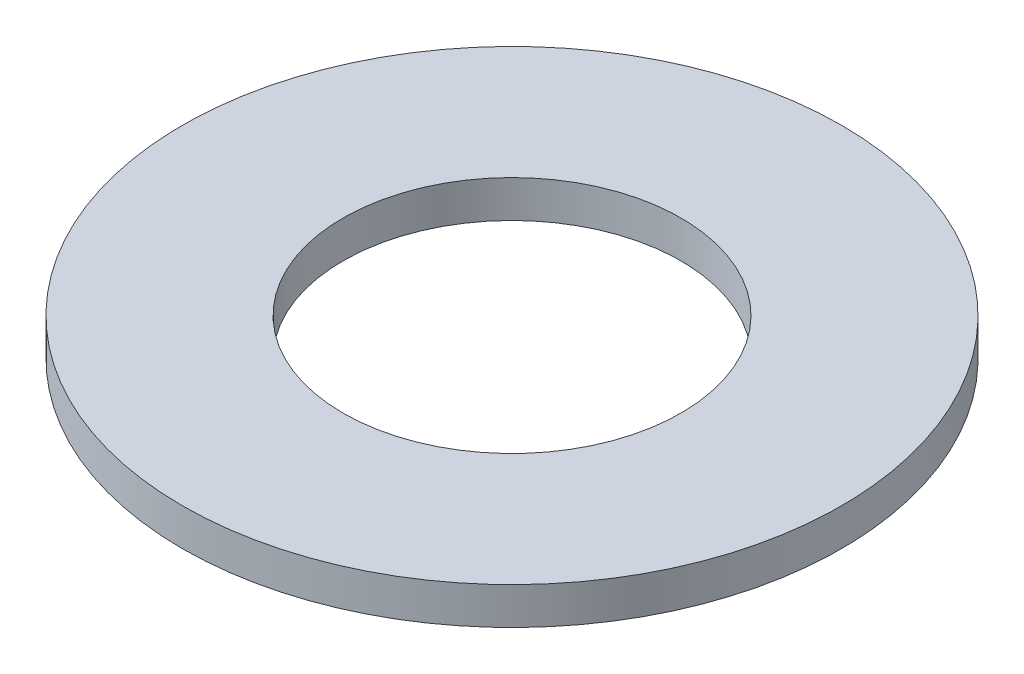
ISO-10303-21;
HEADER;
FILE_DESCRIPTION(('STEP AP214'),'2;1');
FILE_NAME('part.step','',(''),(''),'','','');
FILE_SCHEMA(('AUTOMOTIVE_DESIGN { 1 0 10303 214 1 1 1 1 }'));
ENDSEC;
DATA;
#1=APPLICATION_CONTEXT('core data for automotive mechanical design processes');
#2=APPLICATION_PROTOCOL_DEFINITION('international standard','automotive_design',2000,#1);
#3=PRODUCT_CONTEXT('',#1,'mechanical');
#4=PRODUCT('Part','Part','',(#3));
#5=PRODUCT_RELATED_PRODUCT_CATEGORY('part','',(#4));
#6=PRODUCT_DEFINITION_FORMATION('','',#4);
#7=PRODUCT_DEFINITION_CONTEXT('part definition',#1,'design');
#8=PRODUCT_DEFINITION('design','',#6,#7);
#9=PRODUCT_DEFINITION_SHAPE('','',#8);
#10=(LENGTH_UNIT() NAMED_UNIT(*) SI_UNIT(.MILLI.,.METRE.));
#11=(NAMED_UNIT(*) PLANE_ANGLE_UNIT() SI_UNIT($,.RADIAN.));
#12=(NAMED_UNIT(*) SI_UNIT($,.STERADIAN.) SOLID_ANGLE_UNIT());
#13=UNCERTAINTY_MEASURE_WITH_UNIT(LENGTH_MEASURE(1.E-05),#10,'distance_accuracy_value','');
#14=(GEOMETRIC_REPRESENTATION_CONTEXT(3) GLOBAL_UNCERTAINTY_ASSIGNED_CONTEXT((#13)) GLOBAL_UNIT_ASSIGNED_CONTEXT((#10,
#11,#12)) REPRESENTATION_CONTEXT('',''));
#15=CARTESIAN_POINT('',(0.,0.,0.));
#16=DIRECTION('',(0.,0.,1.));
#17=DIRECTION('',(1.,0.,0.));
#18=AXIS2_PLACEMENT_3D('',#15,#16,#17);
#19=CARTESIAN_POINT('',(0.,11.,0.));
#20=DIRECTION('',(0.,-1.,0.));
#21=DIRECTION('',(0.,0.,-1.));
#22=AXIS2_PLACEMENT_3D('',#19,#20,#21);
#23=CYLINDRICAL_SURFACE('',#22,97.5);
#24=CARTESIAN_POINT('',(0.,11.,0.));
#25=DIRECTION('',(0.,1.,0.));
#26=DIRECTION('',(0.,0.,1.));
#27=AXIS2_PLACEMENT_3D('',#24,#25,#26);
#28=CIRCLE('',#27,97.5);
#29=CARTESIAN_POINT('',(0.,11.,97.5));
#30=VERTEX_POINT('',#29);
#31=EDGE_CURVE('E10',#30,#30,#28,.T.);
#32=ORIENTED_EDGE('',*,*,#31,.F.);
#33=EDGE_LOOP('',(#32));
#34=FACE_BOUND('',#33,.T.);
#35=CARTESIAN_POINT('',(0.,0.,0.));
#36=DIRECTION('',(0.,1.,0.));
#37=DIRECTION('',(0.,0.,1.));
#38=AXIS2_PLACEMENT_3D('',#35,#36,#37);
#39=CIRCLE('',#38,97.5);
#40=CARTESIAN_POINT('',(0.,0.,97.5));
#41=VERTEX_POINT('',#40);
#42=EDGE_CURVE('E37',#41,#41,#39,.T.);
#43=ORIENTED_EDGE('',*,*,#42,.T.);
#44=EDGE_LOOP('',(#43));
#45=FACE_BOUND('',#44,.T.);
#46=ADVANCED_FACE('F40',(#34,#45),#23,.T.);
#47=CARTESIAN_POINT('',(0.,11.,0.));
#48=DIRECTION('',(0.,1.,0.));
#49=DIRECTION('',(0.,0.,1.));
#50=AXIS2_PLACEMENT_3D('',#47,#48,#49);
#51=PLANE('',#50);
#52=CARTESIAN_POINT('',(0.,11.,0.));
#53=DIRECTION('',(0.,1.,0.));
#54=DIRECTION('',(0.,0.,1.));
#55=AXIS2_PLACEMENT_3D('',#52,#53,#54);
#56=CIRCLE('',#55,50.);
#57=CARTESIAN_POINT('',(0.,11.,50.));
#58=VERTEX_POINT('',#57);
#59=EDGE_CURVE('E50',#58,#58,#56,.T.);
#60=ORIENTED_EDGE('',*,*,#59,.F.);
#61=EDGE_LOOP('',(#60));
#62=FACE_BOUND('',#61,.T.);
#63=ORIENTED_EDGE('',*,*,#31,.T.);
#64=EDGE_LOOP('',(#63));
#65=FACE_BOUND('',#64,.T.);
#66=ADVANCED_FACE('F59',(#62,#65),#51,.T.);
#67=CARTESIAN_POINT('',(0.,0.,0.));
#68=DIRECTION('',(0.,1.,0.));
#69=DIRECTION('',(0.,0.,1.));
#70=AXIS2_PLACEMENT_3D('',#67,#68,#69);
#71=PLANE('',#70);
#72=CARTESIAN_POINT('',(0.,0.,0.));
#73=DIRECTION('',(0.,1.,0.));
#74=DIRECTION('',(0.,0.,1.));
#75=AXIS2_PLACEMENT_3D('',#72,#73,#74);
#76=CIRCLE('',#75,50.);
#77=CARTESIAN_POINT('',(0.,0.,50.));
#78=VERTEX_POINT('',#77);
#79=EDGE_CURVE('E47',#78,#78,#76,.T.);
#80=ORIENTED_EDGE('',*,*,#79,.T.);
#81=EDGE_LOOP('',(#80));
#82=FACE_BOUND('',#81,.T.);
#83=ORIENTED_EDGE('',*,*,#42,.F.);
#84=EDGE_LOOP('',(#83));
#85=FACE_BOUND('',#84,.T.);
#86=ADVANCED_FACE('F58',(#82,#85),#71,.F.);
#87=CARTESIAN_POINT('',(0.,11.,0.));
#88=DIRECTION('',(0.,-1.,0.));
#89=DIRECTION('',(0.,0.,-1.));
#90=AXIS2_PLACEMENT_3D('',#87,#88,#89);
#91=CYLINDRICAL_SURFACE('',#90,50.);
#92=ORIENTED_EDGE('',*,*,#59,.T.);
#93=EDGE_LOOP('',(#92));
#94=FACE_BOUND('',#93,.T.);
#95=ORIENTED_EDGE('',*,*,#79,.F.);
#96=EDGE_LOOP('',(#95));
#97=FACE_BOUND('',#96,.T.);
#98=ADVANCED_FACE('F54',(#94,#97),#91,.F.);
#99=CLOSED_SHELL('',(#46,#66,#86,#98));
#100=MANIFOLD_SOLID_BREP('B2',#99);
#101=ADVANCED_BREP_SHAPE_REPRESENTATION('',(#18,#100),#14);
#102=SHAPE_DEFINITION_REPRESENTATION(#9,#101);
ENDSEC;
END-ISO-10303-21;
